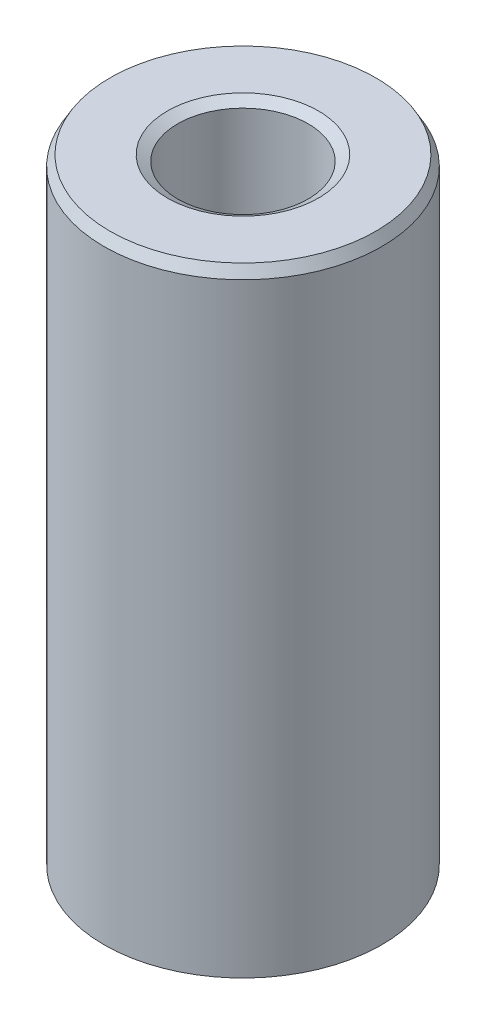
ISO-10303-21;
HEADER;
FILE_DESCRIPTION(('STEP AP214'),'2;1');
FILE_NAME('part.step','',(''),(''),'','','');
FILE_SCHEMA(('AUTOMOTIVE_DESIGN { 1 0 10303 214 1 1 1 1 }'));
ENDSEC;
DATA;
#1=APPLICATION_CONTEXT('core data for automotive mechanical design processes');
#2=APPLICATION_PROTOCOL_DEFINITION('international standard','automotive_design',2000,#1);
#3=PRODUCT_CONTEXT('',#1,'mechanical');
#4=PRODUCT('Part','Part','',(#3));
#5=PRODUCT_RELATED_PRODUCT_CATEGORY('part','',(#4));
#6=PRODUCT_DEFINITION_FORMATION('','',#4);
#7=PRODUCT_DEFINITION_CONTEXT('part definition',#1,'design');
#8=PRODUCT_DEFINITION('design','',#6,#7);
#9=PRODUCT_DEFINITION_SHAPE('','',#8);
#10=(LENGTH_UNIT() NAMED_UNIT(*) SI_UNIT(.MILLI.,.METRE.));
#11=(NAMED_UNIT(*) PLANE_ANGLE_UNIT() SI_UNIT($,.RADIAN.));
#12=(NAMED_UNIT(*) SI_UNIT($,.STERADIAN.) SOLID_ANGLE_UNIT());
#13=UNCERTAINTY_MEASURE_WITH_UNIT(LENGTH_MEASURE(1.E-05),#10,'distance_accuracy_value','');
#14=(GEOMETRIC_REPRESENTATION_CONTEXT(3) GLOBAL_UNCERTAINTY_ASSIGNED_CONTEXT((#13)) GLOBAL_UNIT_ASSIGNED_CONTEXT((#10,
#11,#12)) REPRESENTATION_CONTEXT('',''));
#15=CARTESIAN_POINT('',(0.,0.,0.));
#16=DIRECTION('',(0.,0.,1.));
#17=DIRECTION('',(1.,0.,0.));
#18=AXIS2_PLACEMENT_3D('',#15,#16,#17);
#19=CARTESIAN_POINT('',(0.,100.612969932322,0.));
#20=DIRECTION('',(0.,-1.,0.));
#21=DIRECTION('',(0.,0.,-1.));
#22=AXIS2_PLACEMENT_3D('',#19,#20,#21);
#23=CYLINDRICAL_SURFACE('',#22,22.5);
#24=CARTESIAN_POINT('',(0.,0.964304048394371,0.));
#25=DIRECTION('',(0.,1.,0.));
#26=DIRECTION('',(0.,0.,1.));
#27=AXIS2_PLACEMENT_3D('',#24,#25,#26);
#28=CIRCLE('',#27,22.5);
#29=CARTESIAN_POINT('',(0.,0.964304048394371,22.5));
#30=VERTEX_POINT('',#29);
#31=EDGE_CURVE('E10',#30,#30,#28,.T.);
#32=ORIENTED_EDGE('',*,*,#31,.T.);
#33=EDGE_LOOP('',(#32));
#34=FACE_BOUND('',#33,.T.);
#35=CARTESIAN_POINT('',(0.,98.9427463265583,0.));
#36=DIRECTION('',(0.,1.,0.));
#37=DIRECTION('',(0.,0.,1.));
#38=AXIS2_PLACEMENT_3D('',#35,#36,#37);
#39=CIRCLE('',#38,22.5);
#40=CARTESIAN_POINT('',(0.,98.9427463265583,22.5));
#41=VERTEX_POINT('',#40);
#42=EDGE_CURVE('E50',#41,#41,#39,.F.);
#43=ORIENTED_EDGE('',*,*,#42,.T.);
#44=EDGE_LOOP('',(#43));
#45=FACE_BOUND('',#44,.T.);
#46=ADVANCED_FACE('F39',(#34,#45),#23,.T.);
#47=CARTESIAN_POINT('',(0.,100.612969932322,0.));
#48=DIRECTION('',(0.,1.,0.));
#49=DIRECTION('',(0.,0.,1.));
#50=AXIS2_PLACEMENT_3D('',#47,#48,#49);
#51=PLANE('',#50);
#52=CARTESIAN_POINT('',(0.,100.612969932322,0.));
#53=DIRECTION('',(0.,1.,0.));
#54=DIRECTION('',(0.,0.,1.));
#55=AXIS2_PLACEMENT_3D('',#52,#53,#54);
#56=CIRCLE('',#55,12.2404432917481);
#57=CARTESIAN_POINT('',(0.,100.612969932322,12.2404432917481));
#58=VERTEX_POINT('',#57);
#59=EDGE_CURVE('E58',#58,#58,#56,.F.);
#60=ORIENTED_EDGE('',*,*,#59,.T.);
#61=EDGE_LOOP('',(#60));
#62=FACE_BOUND('',#61,.T.);
#63=CARTESIAN_POINT('',(0.,100.612969932322,0.));
#64=DIRECTION('',(0.,1.,0.));
#65=DIRECTION('',(0.,0.,1.));
#66=AXIS2_PLACEMENT_3D('',#63,#64,#65);
#67=CIRCLE('',#66,21.5356959516056);
#68=CARTESIAN_POINT('',(0.,100.612969932322,21.5356959516056));
#69=VERTEX_POINT('',#68);
#70=EDGE_CURVE('E61',#69,#69,#67,.T.);
#71=ORIENTED_EDGE('',*,*,#70,.T.);
#72=EDGE_LOOP('',(#71));
#73=FACE_BOUND('',#72,.T.);
#74=ADVANCED_FACE('F88',(#62,#73),#51,.T.);
#75=CARTESIAN_POINT('',(0.,0.,0.));
#76=DIRECTION('',(0.,1.,0.));
#77=DIRECTION('',(0.,0.,1.));
#78=AXIS2_PLACEMENT_3D('',#75,#76,#77);
#79=PLANE('',#78);
#80=CARTESIAN_POINT('',(0.,0.,0.));
#81=DIRECTION('',(0.,1.,0.));
#82=DIRECTION('',(0.,0.,1.));
#83=AXIS2_PLACEMENT_3D('',#80,#81,#82);
#84=CIRCLE('',#83,11.534523734379);
#85=CARTESIAN_POINT('',(0.,0.,11.534523734379));
#86=VERTEX_POINT('',#85);
#87=EDGE_CURVE('E51',#86,#86,#84,.T.);
#88=ORIENTED_EDGE('',*,*,#87,.T.);
#89=EDGE_LOOP('',(#88));
#90=FACE_BOUND('',#89,.T.);
#91=CARTESIAN_POINT('',(0.,0.,0.));
#92=DIRECTION('',(0.,1.,0.));
#93=DIRECTION('',(0.,0.,1.));
#94=AXIS2_PLACEMENT_3D('',#91,#92,#93);
#95=CIRCLE('',#94,20.8297763942366);
#96=CARTESIAN_POINT('',(0.,0.,20.8297763942366));
#97=VERTEX_POINT('',#96);
#98=EDGE_CURVE('E54',#97,#97,#95,.F.);
#99=ORIENTED_EDGE('',*,*,#98,.T.);
#100=EDGE_LOOP('',(#99));
#101=FACE_BOUND('',#100,.T.);
#102=ADVANCED_FACE('F83',(#90,#101),#79,.F.);
#103=CARTESIAN_POINT('',(0.,100.612969932322,0.));
#104=DIRECTION('',(0.,-1.,0.));
#105=DIRECTION('',(0.,0.,-1.));
#106=AXIS2_PLACEMENT_3D('',#103,#104,#105);
#107=CYLINDRICAL_SURFACE('',#106,10.5702196859847);
#108=CARTESIAN_POINT('',(0.,99.6486658839274,0.));
#109=DIRECTION('',(0.,1.,0.));
#110=DIRECTION('',(0.,0.,1.));
#111=AXIS2_PLACEMENT_3D('',#108,#109,#110);
#112=CIRCLE('',#111,10.5702196859847);
#113=CARTESIAN_POINT('',(0.,99.6486658839274,10.5702196859846));
#114=VERTEX_POINT('',#113);
#115=EDGE_CURVE('E67',#114,#114,#112,.T.);
#116=ORIENTED_EDGE('',*,*,#115,.T.);
#117=EDGE_LOOP('',(#116));
#118=FACE_BOUND('',#117,.T.);
#119=CARTESIAN_POINT('',(0.,1.67022360576345,0.));
#120=DIRECTION('',(0.,1.,0.));
#121=DIRECTION('',(0.,0.,1.));
#122=AXIS2_PLACEMENT_3D('',#119,#120,#121);
#123=CIRCLE('',#122,10.5702196859847);
#124=CARTESIAN_POINT('',(0.,1.67022360576345,10.5702196859847));
#125=VERTEX_POINT('',#124);
#126=EDGE_CURVE('E69',#125,#125,#123,.F.);
#127=ORIENTED_EDGE('',*,*,#126,.T.);
#128=EDGE_LOOP('',(#127));
#129=FACE_BOUND('',#128,.T.);
#130=ADVANCED_FACE('F71',(#118,#129),#107,.F.);
#131=CARTESIAN_POINT('',(0.,99.6486658839274,0.));
#132=DIRECTION('',(0.,1.,0.));
#133=DIRECTION('',(0.,0.,1.));
#134=AXIS2_PLACEMENT_3D('',#131,#132,#133);
#135=CONICAL_SURFACE('',#134,10.5702196859847,1.0471975511966);
#136=CARTESIAN_POINT('',(0.,100.612969932322,12.2404432917481));
#137=CARTESIAN_POINT('',(0.,100.602925098484,12.2230451291881));
#138=CARTESIAN_POINT('',(0.,100.592880264647,12.205646966628));
#139=CARTESIAN_POINT('',(0.,100.572790596972,12.1708506415079));
#140=CARTESIAN_POINT('',(0.,100.562745763135,12.1534524789479));
#141=CARTESIAN_POINT('',(0.,100.54265609546,12.1186561538278));
#142=CARTESIAN_POINT('',(0.,100.532611261622,12.1012579912678));
#143=CARTESIAN_POINT('',(0.,100.512521593947,12.0664616661477));
#144=CARTESIAN_POINT('',(0.,100.50247676011,12.0490635035877));
#145=CARTESIAN_POINT('',(0.,100.482387092435,12.0142671784676));
#146=CARTESIAN_POINT('',(0.,100.472342258598,11.9968690159076));
#147=CARTESIAN_POINT('',(0.,100.452252590923,11.9620726907875));
#148=CARTESIAN_POINT('',(0.,100.442207757085,11.9446745282275));
#149=CARTESIAN_POINT('',(0.,100.42211808941,11.9098782031074));
#150=CARTESIAN_POINT('',(0.,100.412073255573,11.8924800405474));
#151=CARTESIAN_POINT('',(0.,100.391983587898,11.8576837154273));
#152=CARTESIAN_POINT('',(0.,100.381938754061,11.8402855528673));
#153=CARTESIAN_POINT('',(0.,100.361849086386,11.8054892277472));
#154=CARTESIAN_POINT('',(0.,100.351804252548,11.7880910651872));
#155=CARTESIAN_POINT('',(0.,100.331714584873,11.7532947400671));
#156=CARTESIAN_POINT('',(0.,100.321669751036,11.7358965775071));
#157=CARTESIAN_POINT('',(0.,100.301580083361,11.701100252387));
#158=CARTESIAN_POINT('',(0.,100.291535249524,11.6837020898269));
#159=CARTESIAN_POINT('',(0.,100.271445581849,11.6489057647069));
#160=CARTESIAN_POINT('',(0.,100.261400748011,11.6315076021468));
#161=CARTESIAN_POINT('',(0.,100.241311080337,11.5967112770268));
#162=CARTESIAN_POINT('',(0.,100.231266246499,11.5793131144667));
#163=CARTESIAN_POINT('',(0.,100.211176578824,11.5445167893467));
#164=CARTESIAN_POINT('',(0.,100.201131744987,11.5271186267866));
#165=CARTESIAN_POINT('',(0.,100.181042077312,11.4923223016665));
#166=CARTESIAN_POINT('',(0.,100.170997243474,11.4749241391065));
#167=CARTESIAN_POINT('',(0.,100.1509075758,11.4401278139864));
#168=CARTESIAN_POINT('',(0.,100.140862741962,11.4227296514264));
#169=CARTESIAN_POINT('',(0.,100.120773074287,11.3879333263063));
#170=CARTESIAN_POINT('',(0.,100.11072824045,11.3705351637463));
#171=CARTESIAN_POINT('',(0.,100.090638572775,11.3357388386262));
#172=CARTESIAN_POINT('',(0.,100.080593738937,11.3183406760662));
#173=CARTESIAN_POINT('',(0.,100.060504071263,11.2835443509461));
#174=CARTESIAN_POINT('',(0.,100.050459237425,11.2661461883861));
#175=CARTESIAN_POINT('',(0.,100.03036956975,11.231349863266));
#176=CARTESIAN_POINT('',(0.,100.020324735913,11.213951700706));
#177=CARTESIAN_POINT('',(0.,100.000235068238,11.1791553755859));
#178=CARTESIAN_POINT('',(0.,99.9901902344005,11.1617572130259));
#179=CARTESIAN_POINT('',(0.,99.9701005667256,11.1269608879058));
#180=CARTESIAN_POINT('',(0.,99.9600557328882,11.1095627253458));
#181=CARTESIAN_POINT('',(0.,99.9399660652133,11.0747664002257));
#182=CARTESIAN_POINT('',(0.,99.9299212313758,11.0573682376657));
#183=CARTESIAN_POINT('',(0.,99.9098315637009,11.0225719125456));
#184=CARTESIAN_POINT('',(0.,99.8997867298635,11.0051737499855));
#185=CARTESIAN_POINT('',(0.,99.8796970621886,10.9703774248655));
#186=CARTESIAN_POINT('',(0.,99.8696522283512,10.9529792623054));
#187=CARTESIAN_POINT('',(0.,99.8495625606763,10.9181829371854));
#188=CARTESIAN_POINT('',(0.,99.8395177268388,10.9007847746253));
#189=CARTESIAN_POINT('',(0.,99.819428059164,10.8659884495053));
#190=CARTESIAN_POINT('',(0.,99.8093832253265,10.8485902869452));
#191=CARTESIAN_POINT('',(0.,99.7892935576516,10.8137939618251));
#192=CARTESIAN_POINT('',(0.,99.7792487238142,10.7963957992651));
#193=CARTESIAN_POINT('',(0.,99.7591590561393,10.761599474145));
#194=CARTESIAN_POINT('',(0.,99.7491142223019,10.744201311585));
#195=CARTESIAN_POINT('',(0.,99.729024554627,10.7094049864649));
#196=CARTESIAN_POINT('',(0.,99.7189797207895,10.6920068239049));
#197=CARTESIAN_POINT('',(0.,99.6988900531147,10.6572104987848));
#198=CARTESIAN_POINT('',(0.,99.6888452192772,10.6398123362248));
#199=CARTESIAN_POINT('',(0.,99.6687555516023,10.6050160111047));
#200=CARTESIAN_POINT('',(0.,99.6587107177649,10.5876178485447));
#201=CARTESIAN_POINT('',(0.,99.6486658839274,10.5702196859846));
#202=B_SPLINE_CURVE_WITH_KNOTS('',3,(#136,#137,#138,#139,#140,#141,#142,#143,#144,#145,#146,
#147,#148,#149,#150,#151,#152,#153,#154,#155,#156,#157,#158,#159,#160,#161,#162,#163,#164,#165,
#166,#167,#168,#169,#170,#171,#172,#173,#174,#175,#176,#177,#178,#179,#180,#181,#182,#183,#184,
#185,#186,#187,#188,#189,#190,#191,#192,#193,#194,#195,#196,#197,#198,#199,#200,#201),
.UNSPECIFIED.,.F.,.F.,(4,2,2,2,2,2,2,2,2,2,2,2,2,2,2,2,2,2,2,2,2,2,2,2,2,2,2,2,2,2,2,2,4),(0.,
0.0602690030246526,0.1205380060493,0.180807009073952,0.241076012098599,0.301345015123254,
0.361614018147899,0.421883021172546,0.482152024197199,0.542421027221846,0.602690030246499,
0.662959033271146,0.723228036295793,0.783497039320445,0.843766042345092,0.904035045369745,
0.964304048394392,1.02457305141904,1.08484205444369,1.14511105746834,1.20538006049299,
1.26564906351764,1.32591806654228,1.38618706956694,1.44645607259158,1.50672507561624,
1.56699407864088,1.62726308166553,1.68753208469018,1.74780108771483,1.80807009073948,
1.86833909376413,1.92860809678878),.UNSPECIFIED.);
#203=EDGE_CURVE('BSEAM77',#58,#114,#202,.T.);
#204=ORIENTED_EDGE('',*,*,#59,.F.);
#205=ORIENTED_EDGE('',*,*,#115,.F.);
#206=ORIENTED_EDGE('',*,*,#203,.T.);
#207=ORIENTED_EDGE('',*,*,#203,.F.);
#208=EDGE_LOOP('',(#204,#206,#205,#207));
#209=FACE_BOUND('',#208,.T.);
#210=ADVANCED_FACE('F77',(#209),#135,.F.);
#211=CARTESIAN_POINT('',(0.,0.,0.));
#212=DIRECTION('',(0.,-1.,0.));
#213=DIRECTION('',(0.,0.,-1.));
#214=AXIS2_PLACEMENT_3D('',#211,#212,#213);
#215=CONICAL_SURFACE('',#214,11.534523734379,0.523598775598295);
#216=ORIENTED_EDGE('',*,*,#126,.F.);
#217=EDGE_LOOP('',(#216));
#218=FACE_BOUND('',#217,.T.);
#219=ORIENTED_EDGE('',*,*,#87,.F.);
#220=EDGE_LOOP('',(#219));
#221=FACE_BOUND('',#220,.T.);
#222=ADVANCED_FACE('F73',(#218,#221),#215,.F.);
#223=CARTESIAN_POINT('',(0.,0.964304048394371,0.));
#224=DIRECTION('',(0.,1.,0.));
#225=DIRECTION('',(0.,0.,1.));
#226=AXIS2_PLACEMENT_3D('',#223,#224,#225);
#227=CONICAL_SURFACE('',#226,22.5,1.04719755119661);
#228=ORIENTED_EDGE('',*,*,#98,.F.);
#229=EDGE_LOOP('',(#228));
#230=FACE_BOUND('',#229,.T.);
#231=ORIENTED_EDGE('',*,*,#31,.F.);
#232=EDGE_LOOP('',(#231));
#233=FACE_BOUND('',#232,.T.);
#234=ADVANCED_FACE('F76',(#230,#233),#227,.T.);
#235=CARTESIAN_POINT('',(0.,100.612969932322,0.));
#236=DIRECTION('',(0.,-1.,0.));
#237=DIRECTION('',(0.,0.,-1.));
#238=AXIS2_PLACEMENT_3D('',#235,#236,#237);
#239=CONICAL_SURFACE('',#238,21.5356959516056,0.52359877559829);
#240=ORIENTED_EDGE('',*,*,#42,.F.);
#241=EDGE_LOOP('',(#240));
#242=FACE_BOUND('',#241,.T.);
#243=ORIENTED_EDGE('',*,*,#70,.F.);
#244=EDGE_LOOP('',(#243));
#245=FACE_BOUND('',#244,.T.);
#246=ADVANCED_FACE('F45',(#242,#245),#239,.T.);
#247=CLOSED_SHELL('',(#46,#74,#102,#130,#210,#222,#234,#246));
#248=MANIFOLD_SOLID_BREP('B2',#247);
#249=ADVANCED_BREP_SHAPE_REPRESENTATION('',(#18,#248),#14);
#250=SHAPE_DEFINITION_REPRESENTATION(#9,#249);
ENDSEC;
END-ISO-10303-21;
